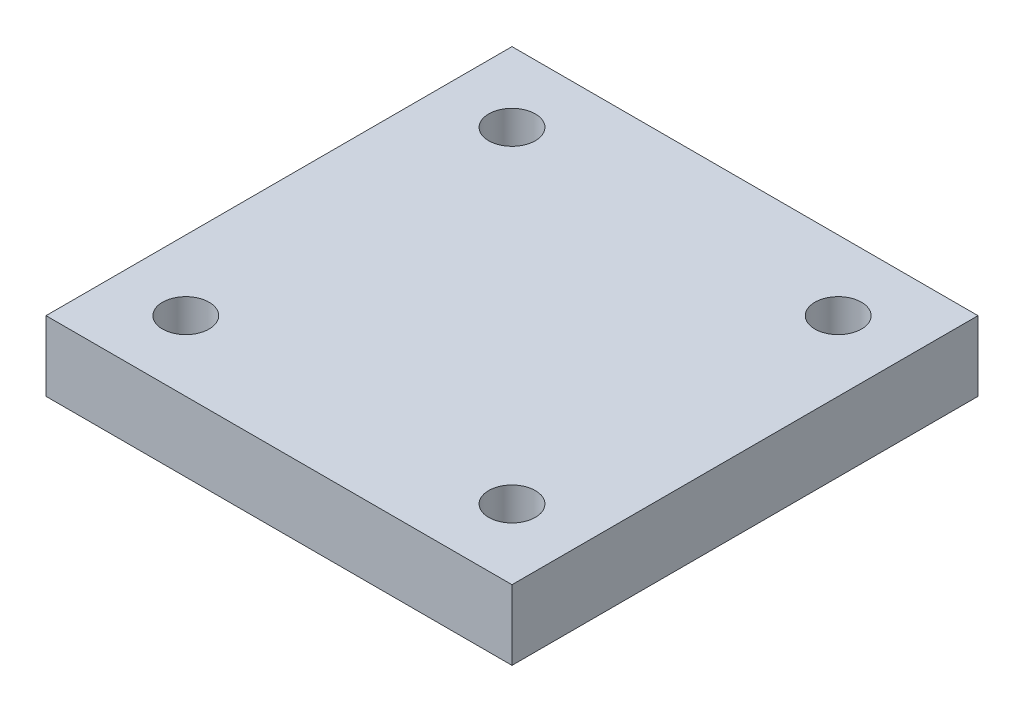
ISO-10303-21;
HEADER;
FILE_DESCRIPTION(('STEP AP214'),'2;1');
FILE_NAME('part.step','',(''),(''),'','','');
FILE_SCHEMA(('AUTOMOTIVE_DESIGN { 1 0 10303 214 1 1 1 1 }'));
ENDSEC;
DATA;
#1=APPLICATION_CONTEXT('core data for automotive mechanical design processes');
#2=APPLICATION_PROTOCOL_DEFINITION('international standard','automotive_design',2000,#1);
#3=PRODUCT_CONTEXT('',#1,'mechanical');
#4=PRODUCT('Part','Part','',(#3));
#5=PRODUCT_RELATED_PRODUCT_CATEGORY('part','',(#4));
#6=PRODUCT_DEFINITION_FORMATION('','',#4);
#7=PRODUCT_DEFINITION_CONTEXT('part definition',#1,'design');
#8=PRODUCT_DEFINITION('design','',#6,#7);
#9=PRODUCT_DEFINITION_SHAPE('','',#8);
#10=(LENGTH_UNIT() NAMED_UNIT(*) SI_UNIT(.MILLI.,.METRE.));
#11=(NAMED_UNIT(*) PLANE_ANGLE_UNIT() SI_UNIT($,.RADIAN.));
#12=(NAMED_UNIT(*) SI_UNIT($,.STERADIAN.) SOLID_ANGLE_UNIT());
#13=UNCERTAINTY_MEASURE_WITH_UNIT(LENGTH_MEASURE(1.E-05),#10,'distance_accuracy_value','');
#14=(GEOMETRIC_REPRESENTATION_CONTEXT(3) GLOBAL_UNCERTAINTY_ASSIGNED_CONTEXT((#13)) GLOBAL_UNIT_ASSIGNED_CONTEXT((#10,
#11,#12)) REPRESENTATION_CONTEXT('',''));
#15=CARTESIAN_POINT('',(0.,0.,0.));
#16=DIRECTION('',(0.,0.,1.));
#17=DIRECTION('',(1.,0.,0.));
#18=AXIS2_PLACEMENT_3D('',#15,#16,#17);
#19=CARTESIAN_POINT('',(0.,22.,0.));
#20=DIRECTION('',(0.,-1.,0.));
#21=DIRECTION('',(0.,0.,-1.));
#22=AXIS2_PLACEMENT_3D('',#19,#20,#21);
#23=CYLINDRICAL_SURFACE('',#22,6.);
#24=CARTESIAN_POINT('',(0.,22.,0.));
#25=DIRECTION('',(0.,1.,0.));
#26=DIRECTION('',(0.,0.,1.));
#27=AXIS2_PLACEMENT_3D('',#24,#25,#26);
#28=CIRCLE('',#27,6.);
#29=CARTESIAN_POINT('',(0.,22.,6.));
#30=VERTEX_POINT('',#29);
#31=EDGE_CURVE('E12',#30,#30,#28,.T.);
#32=ORIENTED_EDGE('',*,*,#31,.F.);
#33=EDGE_LOOP('',(#32));
#34=FACE_BOUND('',#33,.T.);
#35=CARTESIAN_POINT('',(0.,0.,0.));
#36=DIRECTION('',(0.,1.,0.));
#37=DIRECTION('',(0.,0.,1.));
#38=AXIS2_PLACEMENT_3D('',#35,#36,#37);
#39=CIRCLE('',#38,6.);
#40=CARTESIAN_POINT('',(0.,0.,6.));
#41=VERTEX_POINT('',#40);
#42=EDGE_CURVE('E96',#41,#41,#39,.T.);
#43=ORIENTED_EDGE('',*,*,#42,.T.);
#44=EDGE_LOOP('',(#43));
#45=FACE_BOUND('',#44,.T.);
#46=ADVANCED_FACE('F93',(#34,#45),#23,.T.);
#47=CARTESIAN_POINT('',(0.,0.,0.));
#48=DIRECTION('',(0.,1.,0.));
#49=DIRECTION('',(0.,0.,1.));
#50=AXIS2_PLACEMENT_3D('',#47,#48,#49);
#51=PLANE('',#50);
#52=ORIENTED_EDGE('',*,*,#42,.F.);
#53=EDGE_LOOP('',(#52));
#54=FACE_BOUND('',#53,.T.);
#55=ADVANCED_FACE('F178',(#54),#51,.F.);
#56=CARTESIAN_POINT('',(0.,22.,0.));
#57=DIRECTION('',(0.,-1.,0.));
#58=DIRECTION('',(0.,0.,-1.));
#59=AXIS2_PLACEMENT_3D('',#56,#57,#58);
#60=PLANE('',#59);
#61=CARTESIAN_POINT('',(-35.,22.,35.));
#62=DIRECTION('',(0.,1.,0.));
#63=DIRECTION('',(0.,0.,1.));
#64=AXIS2_PLACEMENT_3D('',#61,#62,#63);
#65=CIRCLE('',#64,5.);
#66=CARTESIAN_POINT('',(-35.,22.,40.));
#67=VERTEX_POINT('',#66);
#68=EDGE_CURVE('E235',#67,#67,#65,.T.);
#69=ORIENTED_EDGE('',*,*,#68,.T.);
#70=EDGE_LOOP('',(#69));
#71=FACE_BOUND('',#70,.T.);
#72=CARTESIAN_POINT('',(35.,22.,-35.));
#73=DIRECTION('',(0.,1.,0.));
#74=DIRECTION('',(0.,0.,1.));
#75=AXIS2_PLACEMENT_3D('',#72,#73,#74);
#76=CIRCLE('',#75,5.);
#77=CARTESIAN_POINT('',(35.,22.,-30.));
#78=VERTEX_POINT('',#77);
#79=EDGE_CURVE('E242',#78,#78,#76,.T.);
#80=ORIENTED_EDGE('',*,*,#79,.T.);
#81=EDGE_LOOP('',(#80));
#82=FACE_BOUND('',#81,.T.);
#83=DIRECTION('',(1.,0.,0.));
#84=VECTOR('',#83,1.);
#85=CARTESIAN_POINT('',(-50.,22.,-50.));
#86=LINE('',#85,#84);
#87=CARTESIAN_POINT('',(-50.,22.,-50.));
#88=VERTEX_POINT('',#87);
#89=CARTESIAN_POINT('',(50.,22.,-50.));
#90=VERTEX_POINT('',#89);
#91=EDGE_CURVE('E163',#88,#90,#86,.T.);
#92=ORIENTED_EDGE('',*,*,#91,.T.);
#93=DIRECTION('',(0.,0.,1.));
#94=VECTOR('',#93,1.);
#95=CARTESIAN_POINT('',(50.,22.,-50.));
#96=LINE('',#95,#94);
#97=CARTESIAN_POINT('',(50.,22.,50.));
#98=VERTEX_POINT('',#97);
#99=EDGE_CURVE('E166',#90,#98,#96,.T.);
#100=ORIENTED_EDGE('',*,*,#99,.T.);
#101=DIRECTION('',(1.,0.,0.));
#102=VECTOR('',#101,1.);
#103=CARTESIAN_POINT('',(-50.,22.,50.));
#104=LINE('',#103,#102);
#105=CARTESIAN_POINT('',(-50.,22.,50.));
#106=VERTEX_POINT('',#105);
#107=EDGE_CURVE('E152',#106,#98,#104,.T.);
#108=ORIENTED_EDGE('',*,*,#107,.F.);
#109=DIRECTION('',(0.,0.,1.));
#110=VECTOR('',#109,1.);
#111=CARTESIAN_POINT('',(-50.,22.,-50.));
#112=LINE('',#111,#110);
#113=EDGE_CURVE('E126',#88,#106,#112,.T.);
#114=ORIENTED_EDGE('',*,*,#113,.F.);
#115=EDGE_LOOP('',(#92,#100,#108,#114));
#116=FACE_BOUND('',#115,.T.);
#117=CARTESIAN_POINT('',(35.,22.,35.));
#118=DIRECTION('',(0.,1.,0.));
#119=DIRECTION('',(0.,0.,1.));
#120=AXIS2_PLACEMENT_3D('',#117,#118,#119);
#121=CIRCLE('',#120,5.);
#122=CARTESIAN_POINT('',(35.,22.,40.));
#123=VERTEX_POINT('',#122);
#124=EDGE_CURVE('E184',#123,#123,#121,.T.);
#125=ORIENTED_EDGE('',*,*,#124,.T.);
#126=EDGE_LOOP('',(#125));
#127=FACE_BOUND('',#126,.T.);
#128=CARTESIAN_POINT('',(-35.,22.,-35.));
#129=DIRECTION('',(0.,1.,0.));
#130=DIRECTION('',(0.,0.,1.));
#131=AXIS2_PLACEMENT_3D('',#128,#129,#130);
#132=CIRCLE('',#131,5.);
#133=CARTESIAN_POINT('',(-35.,22.,-30.));
#134=VERTEX_POINT('',#133);
#135=EDGE_CURVE('E188',#134,#134,#132,.T.);
#136=ORIENTED_EDGE('',*,*,#135,.T.);
#137=EDGE_LOOP('',(#136));
#138=FACE_BOUND('',#137,.T.);
#139=ORIENTED_EDGE('',*,*,#31,.T.);
#140=EDGE_LOOP('',(#139));
#141=FACE_BOUND('',#140,.T.);
#142=ADVANCED_FACE('F175',(#71,#82,#116,#127,#138,#141),#60,.T.);
#143=CARTESIAN_POINT('',(0.,37.,0.));
#144=DIRECTION('',(0.,-1.,0.));
#145=DIRECTION('',(0.,0.,-1.));
#146=AXIS2_PLACEMENT_3D('',#143,#144,#145);
#147=PLANE('',#146);
#148=CARTESIAN_POINT('',(-35.,37.,-35.));
#149=DIRECTION('',(0.,1.,0.));
#150=DIRECTION('',(0.,0.,1.));
#151=AXIS2_PLACEMENT_3D('',#148,#149,#150);
#152=CIRCLE('',#151,5.);
#153=CARTESIAN_POINT('',(-35.,37.,-30.));
#154=VERTEX_POINT('',#153);
#155=EDGE_CURVE('E239',#154,#154,#152,.T.);
#156=ORIENTED_EDGE('',*,*,#155,.F.);
#157=EDGE_LOOP('',(#156));
#158=FACE_BOUND('',#157,.T.);
#159=CARTESIAN_POINT('',(35.,37.,35.));
#160=DIRECTION('',(0.,1.,0.));
#161=DIRECTION('',(0.,0.,1.));
#162=AXIS2_PLACEMENT_3D('',#159,#160,#161);
#163=CIRCLE('',#162,5.);
#164=CARTESIAN_POINT('',(35.,37.,40.));
#165=VERTEX_POINT('',#164);
#166=EDGE_CURVE('E167',#165,#165,#163,.T.);
#167=ORIENTED_EDGE('',*,*,#166,.F.);
#168=EDGE_LOOP('',(#167));
#169=FACE_BOUND('',#168,.T.);
#170=DIRECTION('',(1.,0.,0.));
#171=VECTOR('',#170,1.);
#172=CARTESIAN_POINT('',(-50.,37.,-50.));
#173=LINE('',#172,#171);
#174=CARTESIAN_POINT('',(-50.,37.,-50.));
#175=VERTEX_POINT('',#174);
#176=CARTESIAN_POINT('',(50.,37.,-50.));
#177=VERTEX_POINT('',#176);
#178=EDGE_CURVE('E157',#175,#177,#173,.T.);
#179=ORIENTED_EDGE('',*,*,#178,.F.);
#180=DIRECTION('',(0.,0.,1.));
#181=VECTOR('',#180,1.);
#182=CARTESIAN_POINT('',(-50.,37.,-50.));
#183=LINE('',#182,#181);
#184=CARTESIAN_POINT('',(-50.,37.,50.));
#185=VERTEX_POINT('',#184);
#186=EDGE_CURVE('E145',#175,#185,#183,.T.);
#187=ORIENTED_EDGE('',*,*,#186,.T.);
#188=DIRECTION('',(1.,0.,0.));
#189=VECTOR('',#188,1.);
#190=CARTESIAN_POINT('',(-50.,37.,50.));
#191=LINE('',#190,#189);
#192=CARTESIAN_POINT('',(50.,37.,50.));
#193=VERTEX_POINT('',#192);
#194=EDGE_CURVE('E139',#185,#193,#191,.T.);
#195=ORIENTED_EDGE('',*,*,#194,.T.);
#196=DIRECTION('',(0.,0.,1.));
#197=VECTOR('',#196,1.);
#198=CARTESIAN_POINT('',(50.,37.,-50.));
#199=LINE('',#198,#197);
#200=EDGE_CURVE('E144',#177,#193,#199,.T.);
#201=ORIENTED_EDGE('',*,*,#200,.F.);
#202=EDGE_LOOP('',(#179,#187,#195,#201));
#203=FACE_BOUND('',#202,.T.);
#204=CARTESIAN_POINT('',(35.,37.,-35.));
#205=DIRECTION('',(0.,1.,0.));
#206=DIRECTION('',(0.,0.,1.));
#207=AXIS2_PLACEMENT_3D('',#204,#205,#206);
#208=CIRCLE('',#207,5.);
#209=CARTESIAN_POINT('',(35.,37.,-30.));
#210=VERTEX_POINT('',#209);
#211=EDGE_CURVE('E244',#210,#210,#208,.T.);
#212=ORIENTED_EDGE('',*,*,#211,.F.);
#213=EDGE_LOOP('',(#212));
#214=FACE_BOUND('',#213,.T.);
#215=CARTESIAN_POINT('',(-35.,37.,35.));
#216=DIRECTION('',(0.,1.,0.));
#217=DIRECTION('',(0.,0.,1.));
#218=AXIS2_PLACEMENT_3D('',#215,#216,#217);
#219=CIRCLE('',#218,5.);
#220=CARTESIAN_POINT('',(-35.,37.,40.));
#221=VERTEX_POINT('',#220);
#222=EDGE_CURVE('E232',#221,#221,#219,.T.);
#223=ORIENTED_EDGE('',*,*,#222,.F.);
#224=EDGE_LOOP('',(#223));
#225=FACE_BOUND('',#224,.T.);
#226=ADVANCED_FACE('F142',(#158,#169,#203,#214,#225),#147,.F.);
#227=CARTESIAN_POINT('',(-50.,37.,-50.));
#228=DIRECTION('',(0.,0.,-1.));
#229=DIRECTION('',(-1.,0.,0.));
#230=AXIS2_PLACEMENT_3D('',#227,#228,#229);
#231=PLANE('',#230);
#232=ORIENTED_EDGE('',*,*,#91,.F.);
#233=DIRECTION('',(0.,-1.,0.));
#234=VECTOR('',#233,1.);
#235=CARTESIAN_POINT('',(-50.,37.,-50.));
#236=LINE('',#235,#234);
#237=EDGE_CURVE('E109',#175,#88,#236,.T.);
#238=ORIENTED_EDGE('',*,*,#237,.F.);
#239=ORIENTED_EDGE('',*,*,#178,.T.);
#240=DIRECTION('',(0.,-1.,0.));
#241=VECTOR('',#240,1.);
#242=CARTESIAN_POINT('',(50.,37.,-50.));
#243=LINE('',#242,#241);
#244=EDGE_CURVE('E134',#177,#90,#243,.T.);
#245=ORIENTED_EDGE('',*,*,#244,.T.);
#246=EDGE_LOOP('',(#232,#238,#239,#245));
#247=FACE_BOUND('',#246,.T.);
#248=ADVANCED_FACE('F173',(#247),#231,.T.);
#249=CARTESIAN_POINT('',(-50.,37.,-50.));
#250=DIRECTION('',(1.,0.,0.));
#251=DIRECTION('',(0.,0.,-1.));
#252=AXIS2_PLACEMENT_3D('',#249,#250,#251);
#253=PLANE('',#252);
#254=ORIENTED_EDGE('',*,*,#113,.T.);
#255=DIRECTION('',(0.,-1.,0.));
#256=VECTOR('',#255,1.);
#257=CARTESIAN_POINT('',(-50.,37.,50.));
#258=LINE('',#257,#256);
#259=EDGE_CURVE('E154',#185,#106,#258,.T.);
#260=ORIENTED_EDGE('',*,*,#259,.F.);
#261=ORIENTED_EDGE('',*,*,#186,.F.);
#262=ORIENTED_EDGE('',*,*,#237,.T.);
#263=EDGE_LOOP('',(#254,#260,#261,#262));
#264=FACE_BOUND('',#263,.T.);
#265=ADVANCED_FACE('F202',(#264),#253,.F.);
#266=CARTESIAN_POINT('',(-50.,37.,50.));
#267=DIRECTION('',(0.,0.,-1.));
#268=DIRECTION('',(-1.,0.,0.));
#269=AXIS2_PLACEMENT_3D('',#266,#267,#268);
#270=PLANE('',#269);
#271=ORIENTED_EDGE('',*,*,#107,.T.);
#272=DIRECTION('',(0.,-1.,0.));
#273=VECTOR('',#272,1.);
#274=CARTESIAN_POINT('',(50.,37.,50.));
#275=LINE('',#274,#273);
#276=EDGE_CURVE('E149',#193,#98,#275,.T.);
#277=ORIENTED_EDGE('',*,*,#276,.F.);
#278=ORIENTED_EDGE('',*,*,#194,.F.);
#279=ORIENTED_EDGE('',*,*,#259,.T.);
#280=EDGE_LOOP('',(#271,#277,#278,#279));
#281=FACE_BOUND('',#280,.T.);
#282=ADVANCED_FACE('F150',(#281),#270,.F.);
#283=CARTESIAN_POINT('',(50.,37.,-50.));
#284=DIRECTION('',(1.,0.,0.));
#285=DIRECTION('',(0.,0.,-1.));
#286=AXIS2_PLACEMENT_3D('',#283,#284,#285);
#287=PLANE('',#286);
#288=ORIENTED_EDGE('',*,*,#99,.F.);
#289=ORIENTED_EDGE('',*,*,#244,.F.);
#290=ORIENTED_EDGE('',*,*,#200,.T.);
#291=ORIENTED_EDGE('',*,*,#276,.T.);
#292=EDGE_LOOP('',(#288,#289,#290,#291));
#293=FACE_BOUND('',#292,.T.);
#294=ADVANCED_FACE('F156',(#293),#287,.T.);
#295=CARTESIAN_POINT('',(35.,37.,35.));
#296=DIRECTION('',(0.,-1.,0.));
#297=DIRECTION('',(0.,0.,-1.));
#298=AXIS2_PLACEMENT_3D('',#295,#296,#297);
#299=CYLINDRICAL_SURFACE('',#298,5.);
#300=ORIENTED_EDGE('',*,*,#166,.T.);
#301=EDGE_LOOP('',(#300));
#302=FACE_BOUND('',#301,.T.);
#303=ORIENTED_EDGE('',*,*,#124,.F.);
#304=EDGE_LOOP('',(#303));
#305=FACE_BOUND('',#304,.T.);
#306=ADVANCED_FACE('F205',(#302,#305),#299,.F.);
#307=CARTESIAN_POINT('',(35.,37.,-35.));
#308=DIRECTION('',(0.,-1.,0.));
#309=DIRECTION('',(0.,0.,-1.));
#310=AXIS2_PLACEMENT_3D('',#307,#308,#309);
#311=CYLINDRICAL_SURFACE('',#310,5.);
#312=ORIENTED_EDGE('',*,*,#211,.T.);
#313=EDGE_LOOP('',(#312));
#314=FACE_BOUND('',#313,.T.);
#315=ORIENTED_EDGE('',*,*,#79,.F.);
#316=EDGE_LOOP('',(#315));
#317=FACE_BOUND('',#316,.T.);
#318=ADVANCED_FACE('F215',(#314,#317),#311,.F.);
#319=CARTESIAN_POINT('',(-35.,37.,-35.));
#320=DIRECTION('',(0.,-1.,0.));
#321=DIRECTION('',(0.,0.,-1.));
#322=AXIS2_PLACEMENT_3D('',#319,#320,#321);
#323=CYLINDRICAL_SURFACE('',#322,5.);
#324=ORIENTED_EDGE('',*,*,#155,.T.);
#325=EDGE_LOOP('',(#324));
#326=FACE_BOUND('',#325,.T.);
#327=ORIENTED_EDGE('',*,*,#135,.F.);
#328=EDGE_LOOP('',(#327));
#329=FACE_BOUND('',#328,.T.);
#330=ADVANCED_FACE('F219',(#326,#329),#323,.F.);
#331=CARTESIAN_POINT('',(-35.,37.,35.));
#332=DIRECTION('',(0.,-1.,0.));
#333=DIRECTION('',(0.,0.,-1.));
#334=AXIS2_PLACEMENT_3D('',#331,#332,#333);
#335=CYLINDRICAL_SURFACE('',#334,5.);
#336=ORIENTED_EDGE('',*,*,#222,.T.);
#337=EDGE_LOOP('',(#336));
#338=FACE_BOUND('',#337,.T.);
#339=ORIENTED_EDGE('',*,*,#68,.F.);
#340=EDGE_LOOP('',(#339));
#341=FACE_BOUND('',#340,.T.);
#342=ADVANCED_FACE('F223',(#338,#341),#335,.F.);
#343=CLOSED_SHELL('',(#46,#55,#142,#226,#248,#265,#282,#294,#306,#318,#330,#342));
#344=MANIFOLD_SOLID_BREP('B2',#343);
#345=ADVANCED_BREP_SHAPE_REPRESENTATION('',(#18,#344),#14);
#346=SHAPE_DEFINITION_REPRESENTATION(#9,#345);
ENDSEC;
END-ISO-10303-21;
